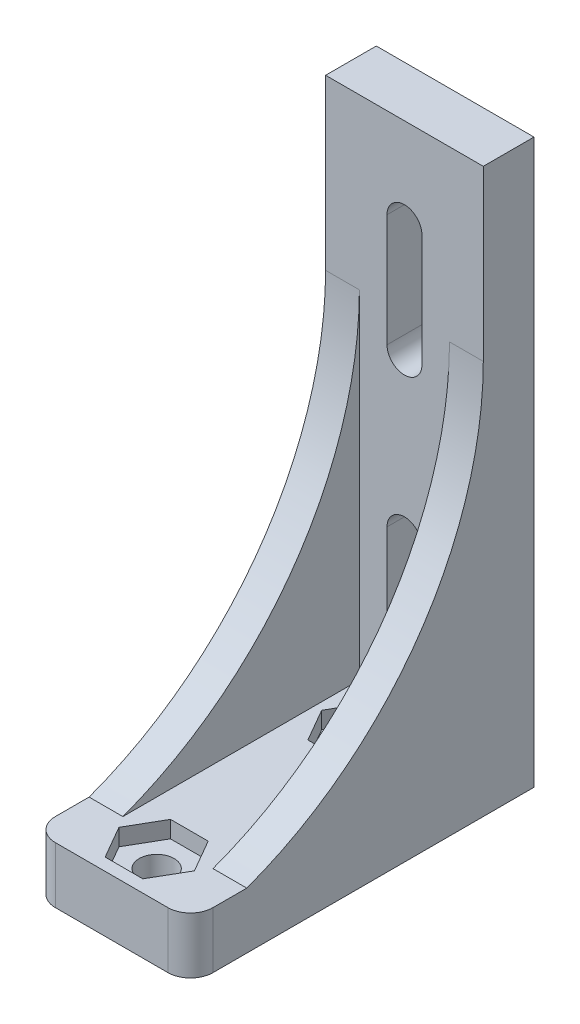
ISO-10303-21;
HEADER;
FILE_DESCRIPTION(('STEP AP214'),'2;1');
FILE_NAME('part.step','',(''),(''),'','','');
FILE_SCHEMA(('AUTOMOTIVE_DESIGN { 1 0 10303 214 1 1 1 1 }'));
ENDSEC;
DATA;
#1=APPLICATION_CONTEXT('core data for automotive mechanical design processes');
#2=APPLICATION_PROTOCOL_DEFINITION('international standard','automotive_design',2000,#1);
#3=PRODUCT_CONTEXT('',#1,'mechanical');
#4=PRODUCT('Part','Part','',(#3));
#5=PRODUCT_RELATED_PRODUCT_CATEGORY('part','',(#4));
#6=PRODUCT_DEFINITION_FORMATION('','',#4);
#7=PRODUCT_DEFINITION_CONTEXT('part definition',#1,'design');
#8=PRODUCT_DEFINITION('design','',#6,#7);
#9=PRODUCT_DEFINITION_SHAPE('','',#8);
#10=(LENGTH_UNIT() NAMED_UNIT(*) SI_UNIT(.MILLI.,.METRE.));
#11=(NAMED_UNIT(*) PLANE_ANGLE_UNIT() SI_UNIT($,.RADIAN.));
#12=(NAMED_UNIT(*) SI_UNIT($,.STERADIAN.) SOLID_ANGLE_UNIT());
#13=UNCERTAINTY_MEASURE_WITH_UNIT(LENGTH_MEASURE(1.E-05),#10,'distance_accuracy_value','');
#14=(GEOMETRIC_REPRESENTATION_CONTEXT(3) GLOBAL_UNCERTAINTY_ASSIGNED_CONTEXT((#13)) GLOBAL_UNIT_ASSIGNED_CONTEXT((#10,
#11,#12)) REPRESENTATION_CONTEXT('',''));
#15=CARTESIAN_POINT('',(0.,0.,0.));
#16=DIRECTION('',(0.,0.,1.));
#17=DIRECTION('',(1.,0.,0.));
#18=AXIS2_PLACEMENT_3D('',#15,#16,#17);
#19=CARTESIAN_POINT('',(50.6196668472011,35.0482499596085,5.99749994229783));
#20=DIRECTION('',(-1.,0.,0.));
#21=DIRECTION('',(0.,0.,1.));
#22=AXIS2_PLACEMENT_3D('',#19,#20,#21);
#23=CYLINDRICAL_SURFACE('',#22,31.997536321035);
#24=DIRECTION('',(-1.,0.,0.));
#25=VECTOR('',#24,1.);
#26=CARTESIAN_POINT('',(50.6196668472011,35.,-26.));
#27=LINE('',#26,#25);
#28=CARTESIAN_POINT('',(14.,35.,-26.));
#29=VERTEX_POINT('',#28);
#30=CARTESIAN_POINT('',(11.,34.9999999999909,-26.));
#31=VERTEX_POINT('',#30);
#32=EDGE_CURVE('E363',#29,#31,#27,.T.);
#33=ORIENTED_EDGE('',*,*,#32,.T.);
#34=CARTESIAN_POINT('',(11.,35.0482499596085,5.99749994229784));
#35=DIRECTION('',(-1.,0.,0.));
#36=DIRECTION('',(0.,0.,1.));
#37=AXIS2_PLACEMENT_3D('',#34,#35,#36);
#38=CIRCLE('',#37,31.997536321035);
#39=CARTESIAN_POINT('',(11.,5.,-5.));
#40=VERTEX_POINT('',#39);
#41=EDGE_CURVE('E287',#31,#40,#38,.T.);
#42=ORIENTED_EDGE('',*,*,#41,.T.);
#43=DIRECTION('',(-1.,0.,0.));
#44=VECTOR('',#43,1.);
#45=CARTESIAN_POINT('',(50.6196668472011,5.,-5.));
#46=LINE('',#45,#44);
#47=CARTESIAN_POINT('',(14.,5.,-5.));
#48=VERTEX_POINT('',#47);
#49=EDGE_CURVE('E370',#48,#40,#46,.T.);
#50=ORIENTED_EDGE('',*,*,#49,.F.);
#51=CARTESIAN_POINT('',(14.,35.0482499596085,5.99749994229784));
#52=DIRECTION('',(-1.,0.,0.));
#53=DIRECTION('',(0.,0.,1.));
#54=AXIS2_PLACEMENT_3D('',#51,#52,#53);
#55=CIRCLE('',#54,31.997536321035);
#56=EDGE_CURVE('E353',#29,#48,#55,.T.);
#57=ORIENTED_EDGE('',*,*,#56,.F.);
#58=EDGE_LOOP('',(#33,#42,#50,#57));
#59=FACE_BOUND('',#58,.T.);
#60=ADVANCED_FACE('F35',(#59),#23,.F.);
#61=CARTESIAN_POINT('',(3.,5.,-5.));
#62=VERTEX_POINT('',#61);
#63=CARTESIAN_POINT('',(0.,5.,-5.));
#64=VERTEX_POINT('',#63);
#65=EDGE_CURVE('E320',#62,#64,#46,.T.);
#66=ORIENTED_EDGE('',*,*,#65,.F.);
#67=CARTESIAN_POINT('',(3.,35.0482499596085,5.99749994229784));
#68=DIRECTION('',(1.,0.,0.));
#69=DIRECTION('',(0.,0.,-1.));
#70=AXIS2_PLACEMENT_3D('',#67,#68,#69);
#71=CIRCLE('',#70,31.997536321035);
#72=CARTESIAN_POINT('',(3.,34.9999999999954,-26.));
#73=VERTEX_POINT('',#72);
#74=EDGE_CURVE('E284',#62,#73,#71,.T.);
#75=ORIENTED_EDGE('',*,*,#74,.T.);
#76=CARTESIAN_POINT('',(0.,35.,-26.));
#77=VERTEX_POINT('',#76);
#78=EDGE_CURVE('E368',#73,#77,#27,.T.);
#79=ORIENTED_EDGE('',*,*,#78,.T.);
#80=CARTESIAN_POINT('',(0.,35.0482499596085,5.99749994229784));
#81=DIRECTION('',(1.,0.,0.));
#82=DIRECTION('',(0.,0.,1.));
#83=AXIS2_PLACEMENT_3D('',#80,#81,#82);
#84=CIRCLE('',#83,31.997536321035);
#85=EDGE_CURVE('E372',#64,#77,#84,.T.);
#86=ORIENTED_EDGE('',*,*,#85,.F.);
#87=EDGE_LOOP('',(#66,#75,#79,#86));
#88=FACE_BOUND('',#87,.T.);
#89=ADVANCED_FACE('F594',(#88),#23,.F.);
#90=CARTESIAN_POINT('',(7.,50.,-22.));
#91=DIRECTION('',(0.,-1.,0.));
#92=DIRECTION('',(0.,0.,-1.));
#93=AXIS2_PLACEMENT_3D('',#90,#91,#92);
#94=CYLINDRICAL_SURFACE('',#93,1.55);
#95=CARTESIAN_POINT('',(7.,0.,-22.));
#96=DIRECTION('',(0.,1.,0.));
#97=DIRECTION('',(0.,0.,1.));
#98=AXIS2_PLACEMENT_3D('',#95,#96,#97);
#99=CIRCLE('',#98,1.55);
#100=CARTESIAN_POINT('',(7.,0.,-20.45));
#101=VERTEX_POINT('',#100);
#102=EDGE_CURVE('E345',#101,#101,#99,.T.);
#103=ORIENTED_EDGE('',*,*,#102,.F.);
#104=EDGE_LOOP('',(#103));
#105=FACE_BOUND('',#104,.T.);
#106=CARTESIAN_POINT('',(7.,3.5,-22.));
#107=DIRECTION('',(0.,1.,0.));
#108=DIRECTION('',(0.,0.,1.));
#109=AXIS2_PLACEMENT_3D('',#106,#107,#108);
#110=CIRCLE('',#109,1.55);
#111=CARTESIAN_POINT('',(7.,3.5,-20.45));
#112=VERTEX_POINT('',#111);
#113=EDGE_CURVE('E279',#112,#112,#110,.T.);
#114=ORIENTED_EDGE('',*,*,#113,.T.);
#115=EDGE_LOOP('',(#114));
#116=FACE_BOUND('',#115,.T.);
#117=ADVANCED_FACE('F599',(#105,#116),#94,.F.);
#118=CARTESIAN_POINT('',(7.,50.,-4.));
#119=DIRECTION('',(0.,-1.,0.));
#120=DIRECTION('',(0.,0.,-1.));
#121=AXIS2_PLACEMENT_3D('',#118,#119,#120);
#122=CYLINDRICAL_SURFACE('',#121,1.55);
#123=CARTESIAN_POINT('',(7.,0.,-4.));
#124=DIRECTION('',(0.,1.,0.));
#125=DIRECTION('',(0.,0.,1.));
#126=AXIS2_PLACEMENT_3D('',#123,#124,#125);
#127=CIRCLE('',#126,1.55);
#128=CARTESIAN_POINT('',(7.,0.,-2.45));
#129=VERTEX_POINT('',#128);
#130=EDGE_CURVE('E342',#129,#129,#127,.T.);
#131=ORIENTED_EDGE('',*,*,#130,.F.);
#132=EDGE_LOOP('',(#131));
#133=FACE_BOUND('',#132,.T.);
#134=CARTESIAN_POINT('',(7.,3.5,-4.));
#135=DIRECTION('',(0.,1.,0.));
#136=DIRECTION('',(0.,0.,1.));
#137=AXIS2_PLACEMENT_3D('',#134,#135,#136);
#138=CIRCLE('',#137,1.55);
#139=CARTESIAN_POINT('',(7.,3.5,-2.45));
#140=VERTEX_POINT('',#139);
#141=EDGE_CURVE('E276',#140,#140,#138,.T.);
#142=ORIENTED_EDGE('',*,*,#141,.T.);
#143=EDGE_LOOP('',(#142));
#144=FACE_BOUND('',#143,.T.);
#145=ADVANCED_FACE('F677',(#133,#144),#122,.F.);
#146=CARTESIAN_POINT('',(0.,50.,0.));
#147=DIRECTION('',(0.,-1.,0.));
#148=DIRECTION('',(0.,0.,-1.));
#149=AXIS2_PLACEMENT_3D('',#146,#147,#148);
#150=PLANE('',#149);
#151=DIRECTION('',(0.,0.,-1.));
#152=VECTOR('',#151,1.);
#153=CARTESIAN_POINT('',(14.,50.,0.));
#154=LINE('',#153,#152);
#155=CARTESIAN_POINT('',(14.,50.,-26.));
#156=VERTEX_POINT('',#155);
#157=CARTESIAN_POINT('',(14.,50.,-30.5));
#158=VERTEX_POINT('',#157);
#159=EDGE_CURVE('E270',#156,#158,#154,.T.);
#160=ORIENTED_EDGE('',*,*,#159,.T.);
#161=DIRECTION('',(1.,0.,0.));
#162=VECTOR('',#161,1.);
#163=CARTESIAN_POINT('',(0.,50.,-30.5));
#164=LINE('',#163,#162);
#165=CARTESIAN_POINT('',(0.,50.,-30.5));
#166=VERTEX_POINT('',#165);
#167=EDGE_CURVE('E50',#166,#158,#164,.T.);
#168=ORIENTED_EDGE('',*,*,#167,.F.);
#169=DIRECTION('',(0.,0.,1.));
#170=VECTOR('',#169,1.);
#171=CARTESIAN_POINT('',(0.,50.,0.));
#172=LINE('',#171,#170);
#173=CARTESIAN_POINT('',(0.,50.,-26.));
#174=VERTEX_POINT('',#173);
#175=EDGE_CURVE('E267',#166,#174,#172,.T.);
#176=ORIENTED_EDGE('',*,*,#175,.T.);
#177=DIRECTION('',(-1.,0.,0.));
#178=VECTOR('',#177,1.);
#179=CARTESIAN_POINT('',(65.9711458407451,50.,-26.));
#180=LINE('',#179,#178);
#181=EDGE_CURVE('E322',#156,#174,#180,.T.);
#182=ORIENTED_EDGE('',*,*,#181,.F.);
#183=EDGE_LOOP('',(#160,#168,#176,#182));
#184=FACE_BOUND('',#183,.T.);
#185=ADVANCED_FACE('F350',(#184),#150,.F.);
#186=CARTESIAN_POINT('',(0.,0.,0.));
#187=DIRECTION('',(0.,-1.,0.));
#188=DIRECTION('',(0.,0.,-1.));
#189=AXIS2_PLACEMENT_3D('',#186,#187,#188);
#190=PLANE('',#189);
#191=DIRECTION('',(1.,0.,0.));
#192=VECTOR('',#191,1.);
#193=CARTESIAN_POINT('',(0.,0.,-30.5));
#194=LINE('',#193,#192);
#195=CARTESIAN_POINT('',(0.,0.,-30.5));
#196=VERTEX_POINT('',#195);
#197=CARTESIAN_POINT('',(14.,0.,-30.5));
#198=VERTEX_POINT('',#197);
#199=EDGE_CURVE('E245',#196,#198,#194,.T.);
#200=ORIENTED_EDGE('',*,*,#199,.T.);
#201=DIRECTION('',(0.,0.,-1.));
#202=VECTOR('',#201,1.);
#203=CARTESIAN_POINT('',(14.,0.,0.));
#204=LINE('',#203,#202);
#205=CARTESIAN_POINT('',(14.,0.,-2.));
#206=VERTEX_POINT('',#205);
#207=EDGE_CURVE('E258',#206,#198,#204,.T.);
#208=ORIENTED_EDGE('',*,*,#207,.F.);
#209=CARTESIAN_POINT('',(12.,0.,-2.));
#210=DIRECTION('',(0.,-1.,0.));
#211=DIRECTION('',(0.,0.,-1.));
#212=AXIS2_PLACEMENT_3D('',#209,#210,#211);
#213=CIRCLE('',#212,2.);
#214=CARTESIAN_POINT('',(12.,0.,0.));
#215=VERTEX_POINT('',#214);
#216=EDGE_CURVE('E293',#206,#215,#213,.T.);
#217=ORIENTED_EDGE('',*,*,#216,.T.);
#218=DIRECTION('',(1.,0.,0.));
#219=VECTOR('',#218,1.);
#220=CARTESIAN_POINT('',(0.,0.,0.));
#221=LINE('',#220,#219);
#222=CARTESIAN_POINT('',(2.,0.,0.));
#223=VERTEX_POINT('',#222);
#224=EDGE_CURVE('E268',#223,#215,#221,.T.);
#225=ORIENTED_EDGE('',*,*,#224,.F.);
#226=CARTESIAN_POINT('',(2.,0.,-2.));
#227=DIRECTION('',(0.,-1.,0.));
#228=DIRECTION('',(0.,0.,-1.));
#229=AXIS2_PLACEMENT_3D('',#226,#227,#228);
#230=CIRCLE('',#229,2.);
#231=CARTESIAN_POINT('',(0.,0.,-2.));
#232=VERTEX_POINT('',#231);
#233=EDGE_CURVE('E291',#223,#232,#230,.T.);
#234=ORIENTED_EDGE('',*,*,#233,.T.);
#235=DIRECTION('',(0.,0.,1.));
#236=VECTOR('',#235,1.);
#237=CARTESIAN_POINT('',(0.,0.,0.));
#238=LINE('',#237,#236);
#239=EDGE_CURVE('E260',#196,#232,#238,.T.);
#240=ORIENTED_EDGE('',*,*,#239,.F.);
#241=EDGE_LOOP('',(#200,#208,#217,#225,#234,#240));
#242=FACE_BOUND('',#241,.T.);
#243=ORIENTED_EDGE('',*,*,#102,.T.);
#244=EDGE_LOOP('',(#243));
#245=FACE_BOUND('',#244,.T.);
#246=ORIENTED_EDGE('',*,*,#130,.T.);
#247=EDGE_LOOP('',(#246));
#248=FACE_BOUND('',#247,.T.);
#249=ADVANCED_FACE('F256',(#242,#245,#248),#190,.T.);
#250=CARTESIAN_POINT('',(0.,50.,0.));
#251=DIRECTION('',(1.,0.,0.));
#252=DIRECTION('',(0.,0.,-1.));
#253=AXIS2_PLACEMENT_3D('',#250,#251,#252);
#254=PLANE('',#253);
#255=ORIENTED_EDGE('',*,*,#175,.F.);
#256=DIRECTION('',(0.,1.,0.));
#257=VECTOR('',#256,1.);
#258=CARTESIAN_POINT('',(0.,-14.0089257261219,-30.5));
#259=LINE('',#258,#257);
#260=EDGE_CURVE('E251',#196,#166,#259,.T.);
#261=ORIENTED_EDGE('',*,*,#260,.F.);
#262=ORIENTED_EDGE('',*,*,#239,.T.);
#263=DIRECTION('',(0.,-1.,0.));
#264=VECTOR('',#263,1.);
#265=CARTESIAN_POINT('',(0.,50.,-2.));
#266=LINE('',#265,#264);
#267=CARTESIAN_POINT('',(0.,5.,-2.));
#268=VERTEX_POINT('',#267);
#269=EDGE_CURVE('E43',#232,#268,#266,.F.);
#270=ORIENTED_EDGE('',*,*,#269,.T.);
#271=DIRECTION('',(0.,0.,1.));
#272=VECTOR('',#271,1.);
#273=CARTESIAN_POINT('',(0.,5.,0.));
#274=LINE('',#273,#272);
#275=EDGE_CURVE('E310',#64,#268,#274,.T.);
#276=ORIENTED_EDGE('',*,*,#275,.F.);
#277=ORIENTED_EDGE('',*,*,#85,.T.);
#278=DIRECTION('',(0.,-1.,0.));
#279=VECTOR('',#278,1.);
#280=CARTESIAN_POINT('',(0.,50.,-26.));
#281=LINE('',#280,#279);
#282=EDGE_CURVE('E323',#174,#77,#281,.T.);
#283=ORIENTED_EDGE('',*,*,#282,.F.);
#284=EDGE_LOOP('',(#255,#261,#262,#270,#276,#277,#283));
#285=FACE_BOUND('',#284,.T.);
#286=ADVANCED_FACE('F308',(#285),#254,.F.);
#287=CARTESIAN_POINT('',(0.,50.,0.));
#288=DIRECTION('',(0.,0.,-1.));
#289=DIRECTION('',(-1.,0.,0.));
#290=AXIS2_PLACEMENT_3D('',#287,#288,#289);
#291=PLANE('',#290);
#292=ORIENTED_EDGE('',*,*,#224,.T.);
#293=DIRECTION('',(0.,-1.,0.));
#294=VECTOR('',#293,1.);
#295=CARTESIAN_POINT('',(12.,50.,0.));
#296=LINE('',#295,#294);
#297=CARTESIAN_POINT('',(12.,5.,0.));
#298=VERTEX_POINT('',#297);
#299=EDGE_CURVE('E298',#215,#298,#296,.F.);
#300=ORIENTED_EDGE('',*,*,#299,.T.);
#301=DIRECTION('',(-1.,0.,0.));
#302=VECTOR('',#301,1.);
#303=CARTESIAN_POINT('',(65.9711458407451,5.,0.));
#304=LINE('',#303,#302);
#305=CARTESIAN_POINT('',(2.,5.,0.));
#306=VERTEX_POINT('',#305);
#307=EDGE_CURVE('E330',#298,#306,#304,.T.);
#308=ORIENTED_EDGE('',*,*,#307,.T.);
#309=DIRECTION('',(0.,-1.,0.));
#310=VECTOR('',#309,1.);
#311=CARTESIAN_POINT('',(2.,50.,0.));
#312=LINE('',#311,#310);
#313=EDGE_CURVE('E295',#306,#223,#312,.T.);
#314=ORIENTED_EDGE('',*,*,#313,.T.);
#315=EDGE_LOOP('',(#292,#300,#308,#314));
#316=FACE_BOUND('',#315,.T.);
#317=ADVANCED_FACE('F328',(#316),#291,.F.);
#318=CARTESIAN_POINT('',(14.,50.,0.));
#319=DIRECTION('',(-1.,0.,0.));
#320=DIRECTION('',(0.,0.,1.));
#321=AXIS2_PLACEMENT_3D('',#318,#319,#320);
#322=PLANE('',#321);
#323=ORIENTED_EDGE('',*,*,#207,.T.);
#324=DIRECTION('',(0.,1.,0.));
#325=VECTOR('',#324,1.);
#326=CARTESIAN_POINT('',(14.,-14.0089257261219,-30.5));
#327=LINE('',#326,#325);
#328=EDGE_CURVE('E241',#198,#158,#327,.T.);
#329=ORIENTED_EDGE('',*,*,#328,.T.);
#330=ORIENTED_EDGE('',*,*,#159,.F.);
#331=DIRECTION('',(0.,1.,0.));
#332=VECTOR('',#331,1.);
#333=CARTESIAN_POINT('',(14.,50.,-26.));
#334=LINE('',#333,#332);
#335=EDGE_CURVE('E334',#29,#156,#334,.T.);
#336=ORIENTED_EDGE('',*,*,#335,.F.);
#337=ORIENTED_EDGE('',*,*,#56,.T.);
#338=DIRECTION('',(0.,0.,-1.));
#339=VECTOR('',#338,1.);
#340=CARTESIAN_POINT('',(14.,5.,0.));
#341=LINE('',#340,#339);
#342=CARTESIAN_POINT('',(14.,5.,-2.));
#343=VERTEX_POINT('',#342);
#344=EDGE_CURVE('E336',#343,#48,#341,.T.);
#345=ORIENTED_EDGE('',*,*,#344,.F.);
#346=DIRECTION('',(0.,-1.,0.));
#347=VECTOR('',#346,1.);
#348=CARTESIAN_POINT('',(14.,50.,-2.));
#349=LINE('',#348,#347);
#350=EDGE_CURVE('E266',#343,#206,#349,.T.);
#351=ORIENTED_EDGE('',*,*,#350,.T.);
#352=EDGE_LOOP('',(#323,#329,#330,#336,#337,#345,#351));
#353=FACE_BOUND('',#352,.T.);
#354=ADVANCED_FACE('F263',(#353),#322,.F.);
#355=CARTESIAN_POINT('',(65.9711458407451,5.,0.));
#356=DIRECTION('',(0.,-1.,0.));
#357=DIRECTION('',(0.,0.,-1.));
#358=AXIS2_PLACEMENT_3D('',#355,#356,#357);
#359=PLANE('',#358);
#360=ORIENTED_EDGE('',*,*,#307,.F.);
#361=CARTESIAN_POINT('',(12.,5.,-2.));
#362=DIRECTION('',(0.,-1.,0.));
#363=DIRECTION('',(0.,0.,-1.));
#364=AXIS2_PLACEMENT_3D('',#361,#362,#363);
#365=CIRCLE('',#364,2.);
#366=EDGE_CURVE('E302',#298,#343,#365,.F.);
#367=ORIENTED_EDGE('',*,*,#366,.T.);
#368=ORIENTED_EDGE('',*,*,#344,.T.);
#369=ORIENTED_EDGE('',*,*,#49,.T.);
#370=DIRECTION('',(0.,0.,1.));
#371=VECTOR('',#370,1.);
#372=CARTESIAN_POINT('',(11.,5.,-26.));
#373=LINE('',#372,#371);
#374=CARTESIAN_POINT('',(11.,5.,-26.));
#375=VERTEX_POINT('',#374);
#376=EDGE_CURVE('E525',#375,#40,#373,.T.);
#377=ORIENTED_EDGE('',*,*,#376,.F.);
#378=DIRECTION('',(1.,0.,0.));
#379=VECTOR('',#378,1.);
#380=CARTESIAN_POINT('',(3.,5.,-26.));
#381=LINE('',#380,#379);
#382=CARTESIAN_POINT('',(3.,5.,-26.));
#383=VERTEX_POINT('',#382);
#384=EDGE_CURVE('E526',#383,#375,#381,.T.);
#385=ORIENTED_EDGE('',*,*,#384,.F.);
#386=DIRECTION('',(0.,0.,-1.));
#387=VECTOR('',#386,1.);
#388=CARTESIAN_POINT('',(3.,5.,-26.));
#389=LINE('',#388,#387);
#390=EDGE_CURVE('E532',#62,#383,#389,.T.);
#391=ORIENTED_EDGE('',*,*,#390,.F.);
#392=ORIENTED_EDGE('',*,*,#65,.T.);
#393=ORIENTED_EDGE('',*,*,#275,.T.);
#394=CARTESIAN_POINT('',(2.,5.,-2.));
#395=DIRECTION('',(0.,-1.,0.));
#396=DIRECTION('',(0.,0.,-1.));
#397=AXIS2_PLACEMENT_3D('',#394,#395,#396);
#398=CIRCLE('',#397,2.);
#399=EDGE_CURVE('E300',#268,#306,#398,.F.);
#400=ORIENTED_EDGE('',*,*,#399,.T.);
#401=EDGE_LOOP('',(#360,#367,#368,#369,#377,#385,#391,#392,#393,#400));
#402=FACE_BOUND('',#401,.T.);
#403=DIRECTION('',(0.5,0.,0.866025403784439));
#404=VECTOR('',#403,1.);
#405=CARTESIAN_POINT('',(3.65136843870018,5.,-4.));
#406=LINE('',#405,#404);
#407=CARTESIAN_POINT('',(3.65136843870018,5.,-4.));
#408=VERTEX_POINT('',#407);
#409=CARTESIAN_POINT('',(5.32568421935009,5.,-1.1));
#410=VERTEX_POINT('',#409);
#411=EDGE_CURVE('E405',#408,#410,#406,.T.);
#412=ORIENTED_EDGE('',*,*,#411,.F.);
#413=DIRECTION('',(-0.5,0.,0.866025403784439));
#414=VECTOR('',#413,1.);
#415=CARTESIAN_POINT('',(5.32568421935009,5.,-6.9));
#416=LINE('',#415,#414);
#417=CARTESIAN_POINT('',(5.32568421935009,5.,-6.9));
#418=VERTEX_POINT('',#417);
#419=EDGE_CURVE('E403',#418,#408,#416,.T.);
#420=ORIENTED_EDGE('',*,*,#419,.F.);
#421=DIRECTION('',(-1.,0.,0.));
#422=VECTOR('',#421,1.);
#423=CARTESIAN_POINT('',(8.67431578064992,5.,-6.9));
#424=LINE('',#423,#422);
#425=CARTESIAN_POINT('',(8.67431578064992,5.,-6.9));
#426=VERTEX_POINT('',#425);
#427=EDGE_CURVE('E400',#426,#418,#424,.T.);
#428=ORIENTED_EDGE('',*,*,#427,.F.);
#429=DIRECTION('',(-0.5,0.,-0.866025403784438));
#430=VECTOR('',#429,1.);
#431=CARTESIAN_POINT('',(10.3486315612998,5.,-4.));
#432=LINE('',#431,#430);
#433=CARTESIAN_POINT('',(10.3486315612998,5.,-4.));
#434=VERTEX_POINT('',#433);
#435=EDGE_CURVE('E397',#434,#426,#432,.T.);
#436=ORIENTED_EDGE('',*,*,#435,.F.);
#437=DIRECTION('',(0.5,0.,-0.866025403784439));
#438=VECTOR('',#437,1.);
#439=CARTESIAN_POINT('',(8.67431578064992,5.,-1.1));
#440=LINE('',#439,#438);
#441=CARTESIAN_POINT('',(8.67431578064992,5.,-1.1));
#442=VERTEX_POINT('',#441);
#443=EDGE_CURVE('E395',#442,#434,#440,.T.);
#444=ORIENTED_EDGE('',*,*,#443,.F.);
#445=DIRECTION('',(1.,0.,0.));
#446=VECTOR('',#445,1.);
#447=CARTESIAN_POINT('',(5.32568421935009,5.,-1.1));
#448=LINE('',#447,#446);
#449=EDGE_CURVE('E379',#410,#442,#448,.T.);
#450=ORIENTED_EDGE('',*,*,#449,.F.);
#451=EDGE_LOOP('',(#412,#420,#428,#436,#444,#450));
#452=FACE_BOUND('',#451,.T.);
#453=DIRECTION('',(0.5,0.,0.866025403784439));
#454=VECTOR('',#453,1.);
#455=CARTESIAN_POINT('',(3.65136843870017,5.,-22.));
#456=LINE('',#455,#454);
#457=CARTESIAN_POINT('',(3.65136843870017,5.,-22.));
#458=VERTEX_POINT('',#457);
#459=CARTESIAN_POINT('',(5.32568421935008,5.,-19.1));
#460=VERTEX_POINT('',#459);
#461=EDGE_CURVE('E428',#458,#460,#456,.T.);
#462=ORIENTED_EDGE('',*,*,#461,.F.);
#463=DIRECTION('',(-0.5,0.,0.866025403784439));
#464=VECTOR('',#463,1.);
#465=CARTESIAN_POINT('',(5.32568421935009,5.,-24.9));
#466=LINE('',#465,#464);
#467=CARTESIAN_POINT('',(5.32568421935009,5.,-24.9));
#468=VERTEX_POINT('',#467);
#469=EDGE_CURVE('E456',#468,#458,#466,.T.);
#470=ORIENTED_EDGE('',*,*,#469,.F.);
#471=DIRECTION('',(-1.,0.,0.));
#472=VECTOR('',#471,1.);
#473=CARTESIAN_POINT('',(8.67431578064991,5.,-24.9));
#474=LINE('',#473,#472);
#475=CARTESIAN_POINT('',(8.67431578064991,5.,-24.9));
#476=VERTEX_POINT('',#475);
#477=EDGE_CURVE('E453',#476,#468,#474,.T.);
#478=ORIENTED_EDGE('',*,*,#477,.F.);
#479=DIRECTION('',(-0.5,0.,-0.866025403784439));
#480=VECTOR('',#479,1.);
#481=CARTESIAN_POINT('',(10.3486315612998,5.,-22.));
#482=LINE('',#481,#480);
#483=CARTESIAN_POINT('',(10.3486315612998,5.,-22.));
#484=VERTEX_POINT('',#483);
#485=EDGE_CURVE('E450',#484,#476,#482,.T.);
#486=ORIENTED_EDGE('',*,*,#485,.F.);
#487=DIRECTION('',(0.5,0.,-0.866025403784439));
#488=VECTOR('',#487,1.);
#489=CARTESIAN_POINT('',(8.67431578064991,5.,-19.1));
#490=LINE('',#489,#488);
#491=CARTESIAN_POINT('',(8.67431578064991,5.,-19.1));
#492=VERTEX_POINT('',#491);
#493=EDGE_CURVE('E447',#492,#484,#490,.T.);
#494=ORIENTED_EDGE('',*,*,#493,.F.);
#495=DIRECTION('',(1.,0.,0.));
#496=VECTOR('',#495,1.);
#497=CARTESIAN_POINT('',(5.32568421935008,5.,-19.1));
#498=LINE('',#497,#496);
#499=EDGE_CURVE('E444',#460,#492,#498,.T.);
#500=ORIENTED_EDGE('',*,*,#499,.F.);
#501=EDGE_LOOP('',(#462,#470,#478,#486,#494,#500));
#502=FACE_BOUND('',#501,.T.);
#503=ADVANCED_FACE('F315',(#402,#452,#502),#359,.F.);
#504=CARTESIAN_POINT('',(65.9711458407451,50.,-26.));
#505=DIRECTION('',(0.,0.,-1.));
#506=DIRECTION('',(-1.,0.,0.));
#507=AXIS2_PLACEMENT_3D('',#504,#505,#506);
#508=PLANE('',#507);
#509=ORIENTED_EDGE('',*,*,#181,.T.);
#510=ORIENTED_EDGE('',*,*,#282,.T.);
#511=ORIENTED_EDGE('',*,*,#78,.F.);
#512=DIRECTION('',(0.,1.,0.));
#513=VECTOR('',#512,1.);
#514=CARTESIAN_POINT('',(3.,-29.3548497304238,-26.));
#515=LINE('',#514,#513);
#516=EDGE_CURVE('E530',#383,#73,#515,.T.);
#517=ORIENTED_EDGE('',*,*,#516,.F.);
#518=ORIENTED_EDGE('',*,*,#384,.T.);
#519=DIRECTION('',(0.,1.,0.));
#520=VECTOR('',#519,1.);
#521=CARTESIAN_POINT('',(11.,-29.3548497304238,-26.));
#522=LINE('',#521,#520);
#523=EDGE_CURVE('E366',#375,#31,#522,.T.);
#524=ORIENTED_EDGE('',*,*,#523,.T.);
#525=ORIENTED_EDGE('',*,*,#32,.F.);
#526=ORIENTED_EDGE('',*,*,#335,.T.);
#527=EDGE_LOOP('',(#509,#510,#511,#517,#518,#524,#525,#526));
#528=FACE_BOUND('',#527,.T.);
#529=CARTESIAN_POINT('',(6.99999999999999,42.,-26.));
#530=DIRECTION('',(0.,0.,-1.));
#531=DIRECTION('',(-1.,0.,0.));
#532=AXIS2_PLACEMENT_3D('',#529,#530,#531);
#533=CIRCLE('',#532,1.55);
#534=CARTESIAN_POINT('',(8.55,42.,-26.));
#535=VERTEX_POINT('',#534);
#536=CARTESIAN_POINT('',(5.45,42.,-26.));
#537=VERTEX_POINT('',#536);
#538=EDGE_CURVE('E502',#535,#537,#533,.F.);
#539=ORIENTED_EDGE('',*,*,#538,.F.);
#540=DIRECTION('',(0.,1.,0.));
#541=VECTOR('',#540,1.);
#542=CARTESIAN_POINT('',(8.55,32.,-26.));
#543=LINE('',#542,#541);
#544=CARTESIAN_POINT('',(8.55,32.,-26.));
#545=VERTEX_POINT('',#544);
#546=EDGE_CURVE('E505',#545,#535,#543,.T.);
#547=ORIENTED_EDGE('',*,*,#546,.F.);
#548=CARTESIAN_POINT('',(6.99999999999999,32.,-26.));
#549=DIRECTION('',(0.,0.,-1.));
#550=DIRECTION('',(-1.,0.,0.));
#551=AXIS2_PLACEMENT_3D('',#548,#549,#550);
#552=CIRCLE('',#551,1.55);
#553=CARTESIAN_POINT('',(5.44999999999999,32.,-26.));
#554=VERTEX_POINT('',#553);
#555=EDGE_CURVE('E508',#554,#545,#552,.F.);
#556=ORIENTED_EDGE('',*,*,#555,.F.);
#557=DIRECTION('',(0.,-1.,0.));
#558=VECTOR('',#557,1.);
#559=CARTESIAN_POINT('',(5.44999999999999,32.,-26.));
#560=LINE('',#559,#558);
#561=EDGE_CURVE('E499',#537,#554,#560,.T.);
#562=ORIENTED_EDGE('',*,*,#561,.F.);
#563=EDGE_LOOP('',(#539,#547,#556,#562));
#564=FACE_BOUND('',#563,.T.);
#565=CARTESIAN_POINT('',(6.99999999999999,8.,-26.));
#566=DIRECTION('',(0.,0.,-1.));
#567=DIRECTION('',(-1.,0.,0.));
#568=AXIS2_PLACEMENT_3D('',#565,#566,#567);
#569=CIRCLE('',#568,1.55);
#570=CARTESIAN_POINT('',(5.44999999999999,8.,-26.));
#571=VERTEX_POINT('',#570);
#572=CARTESIAN_POINT('',(8.55,8.,-26.));
#573=VERTEX_POINT('',#572);
#574=EDGE_CURVE('E484',#571,#573,#569,.F.);
#575=ORIENTED_EDGE('',*,*,#574,.F.);
#576=DIRECTION('',(0.,-1.,0.));
#577=VECTOR('',#576,1.);
#578=CARTESIAN_POINT('',(5.44999999999999,8.,-26.));
#579=LINE('',#578,#577);
#580=CARTESIAN_POINT('',(5.44999999999999,18.,-26.));
#581=VERTEX_POINT('',#580);
#582=EDGE_CURVE('E487',#581,#571,#579,.T.);
#583=ORIENTED_EDGE('',*,*,#582,.F.);
#584=CARTESIAN_POINT('',(6.99999999999999,18.,-26.));
#585=DIRECTION('',(0.,0.,-1.));
#586=DIRECTION('',(-1.,0.,0.));
#587=AXIS2_PLACEMENT_3D('',#584,#585,#586);
#588=CIRCLE('',#587,1.55);
#589=CARTESIAN_POINT('',(8.55,18.,-26.));
#590=VERTEX_POINT('',#589);
#591=EDGE_CURVE('E477',#590,#581,#588,.F.);
#592=ORIENTED_EDGE('',*,*,#591,.F.);
#593=DIRECTION('',(0.,1.,0.));
#594=VECTOR('',#593,1.);
#595=CARTESIAN_POINT('',(8.55,8.,-26.));
#596=LINE('',#595,#594);
#597=EDGE_CURVE('E480',#573,#590,#596,.T.);
#598=ORIENTED_EDGE('',*,*,#597,.F.);
#599=EDGE_LOOP('',(#575,#583,#592,#598));
#600=FACE_BOUND('',#599,.T.);
#601=ADVANCED_FACE('F357',(#528,#564,#600),#508,.F.);
#602=CARTESIAN_POINT('',(6.99999999999999,32.,-12.5382022003003));
#603=DIRECTION('',(0.,0.,-1.));
#604=DIRECTION('',(-1.,0.,0.));
#605=AXIS2_PLACEMENT_3D('',#602,#603,#604);
#606=CYLINDRICAL_SURFACE('',#605,1.55);
#607=DIRECTION('',(0.,0.,-1.));
#608=VECTOR('',#607,1.);
#609=CARTESIAN_POINT('',(8.55,32.,-12.5382022003003));
#610=LINE('',#609,#608);
#611=CARTESIAN_POINT('',(8.55,32.,-30.5));
#612=VERTEX_POINT('',#611);
#613=EDGE_CURVE('E506',#545,#612,#610,.T.);
#614=ORIENTED_EDGE('',*,*,#613,.T.);
#615=CARTESIAN_POINT('',(6.99999999999999,32.,-30.5));
#616=DIRECTION('',(0.,0.,1.));
#617=DIRECTION('',(1.,0.,0.));
#618=AXIS2_PLACEMENT_3D('',#615,#616,#617);
#619=CIRCLE('',#618,1.55);
#620=CARTESIAN_POINT('',(5.44999999999999,32.,-30.5));
#621=VERTEX_POINT('',#620);
#622=EDGE_CURVE('E534',#612,#621,#619,.F.);
#623=ORIENTED_EDGE('',*,*,#622,.T.);
#624=DIRECTION('',(0.,0.,-1.));
#625=VECTOR('',#624,1.);
#626=CARTESIAN_POINT('',(5.44999999999999,32.,-12.5382022003003));
#627=LINE('',#626,#625);
#628=EDGE_CURVE('E283',#554,#621,#627,.T.);
#629=ORIENTED_EDGE('',*,*,#628,.F.);
#630=ORIENTED_EDGE('',*,*,#555,.T.);
#631=EDGE_LOOP('',(#614,#623,#629,#630));
#632=FACE_BOUND('',#631,.T.);
#633=ADVANCED_FACE('F581',(#632),#606,.F.);
#634=CARTESIAN_POINT('',(8.55,32.,-12.5382022003003));
#635=DIRECTION('',(1.,0.,0.));
#636=DIRECTION('',(0.,0.,-1.));
#637=AXIS2_PLACEMENT_3D('',#634,#635,#636);
#638=PLANE('',#637);
#639=DIRECTION('',(0.,0.,-1.));
#640=VECTOR('',#639,1.);
#641=CARTESIAN_POINT('',(8.55,42.,-12.5382022003003));
#642=LINE('',#641,#640);
#643=CARTESIAN_POINT('',(8.55,42.,-30.5));
#644=VERTEX_POINT('',#643);
#645=EDGE_CURVE('E513',#535,#644,#642,.T.);
#646=ORIENTED_EDGE('',*,*,#645,.T.);
#647=DIRECTION('',(0.,-1.,0.));
#648=VECTOR('',#647,1.);
#649=CARTESIAN_POINT('',(8.55,32.,-30.5));
#650=LINE('',#649,#648);
#651=EDGE_CURVE('E539',#644,#612,#650,.T.);
#652=ORIENTED_EDGE('',*,*,#651,.T.);
#653=ORIENTED_EDGE('',*,*,#613,.F.);
#654=ORIENTED_EDGE('',*,*,#546,.T.);
#655=EDGE_LOOP('',(#646,#652,#653,#654));
#656=FACE_BOUND('',#655,.T.);
#657=ADVANCED_FACE('F576',(#656),#638,.F.);
#658=CARTESIAN_POINT('',(6.99999999999999,42.,-12.5382022003003));
#659=DIRECTION('',(0.,0.,-1.));
#660=DIRECTION('',(-1.,0.,0.));
#661=AXIS2_PLACEMENT_3D('',#658,#659,#660);
#662=CYLINDRICAL_SURFACE('',#661,1.55);
#663=DIRECTION('',(0.,0.,-1.));
#664=VECTOR('',#663,1.);
#665=CARTESIAN_POINT('',(5.44999999999999,42.,-12.5382022003003));
#666=LINE('',#665,#664);
#667=CARTESIAN_POINT('',(5.44999999999999,42.,-30.5));
#668=VERTEX_POINT('',#667);
#669=EDGE_CURVE('E516',#537,#668,#666,.T.);
#670=ORIENTED_EDGE('',*,*,#669,.T.);
#671=CARTESIAN_POINT('',(6.99999999999999,42.,-30.5));
#672=DIRECTION('',(0.,0.,1.));
#673=DIRECTION('',(1.,0.,0.));
#674=AXIS2_PLACEMENT_3D('',#671,#672,#673);
#675=CIRCLE('',#674,1.55);
#676=EDGE_CURVE('E58',#668,#644,#675,.F.);
#677=ORIENTED_EDGE('',*,*,#676,.T.);
#678=ORIENTED_EDGE('',*,*,#645,.F.);
#679=ORIENTED_EDGE('',*,*,#538,.T.);
#680=EDGE_LOOP('',(#670,#677,#678,#679));
#681=FACE_BOUND('',#680,.T.);
#682=ADVANCED_FACE('F574',(#681),#662,.F.);
#683=CARTESIAN_POINT('',(5.44999999999999,32.,-12.5382022003003));
#684=DIRECTION('',(-1.,0.,0.));
#685=DIRECTION('',(0.,0.,1.));
#686=AXIS2_PLACEMENT_3D('',#683,#684,#685);
#687=PLANE('',#686);
#688=ORIENTED_EDGE('',*,*,#628,.T.);
#689=DIRECTION('',(0.,1.,0.));
#690=VECTOR('',#689,1.);
#691=CARTESIAN_POINT('',(5.44999999999999,32.,-30.5));
#692=LINE('',#691,#690);
#693=EDGE_CURVE('E543',#621,#668,#692,.T.);
#694=ORIENTED_EDGE('',*,*,#693,.T.);
#695=ORIENTED_EDGE('',*,*,#669,.F.);
#696=ORIENTED_EDGE('',*,*,#561,.T.);
#697=EDGE_LOOP('',(#688,#694,#695,#696));
#698=FACE_BOUND('',#697,.T.);
#699=ADVANCED_FACE('F583',(#698),#687,.F.);
#700=CARTESIAN_POINT('',(6.99999999999999,8.,-12.5382022003003));
#701=DIRECTION('',(0.,0.,-1.));
#702=DIRECTION('',(-1.,0.,0.));
#703=AXIS2_PLACEMENT_3D('',#700,#701,#702);
#704=CYLINDRICAL_SURFACE('',#703,1.55);
#705=DIRECTION('',(0.,0.,-1.));
#706=VECTOR('',#705,1.);
#707=CARTESIAN_POINT('',(8.55,8.,-12.5382022003003));
#708=LINE('',#707,#706);
#709=CARTESIAN_POINT('',(8.55,8.,-30.5));
#710=VERTEX_POINT('',#709);
#711=EDGE_CURVE('E481',#573,#710,#708,.T.);
#712=ORIENTED_EDGE('',*,*,#711,.T.);
#713=CARTESIAN_POINT('',(6.99999999999999,8.,-30.5));
#714=DIRECTION('',(0.,0.,1.));
#715=DIRECTION('',(1.,0.,0.));
#716=AXIS2_PLACEMENT_3D('',#713,#714,#715);
#717=CIRCLE('',#716,1.55);
#718=CARTESIAN_POINT('',(5.44999999999999,8.,-30.5));
#719=VERTEX_POINT('',#718);
#720=EDGE_CURVE('E545',#710,#719,#717,.F.);
#721=ORIENTED_EDGE('',*,*,#720,.T.);
#722=DIRECTION('',(0.,0.,-1.));
#723=VECTOR('',#722,1.);
#724=CARTESIAN_POINT('',(5.44999999999999,8.,-12.5382022003003));
#725=LINE('',#724,#723);
#726=EDGE_CURVE('E496',#571,#719,#725,.T.);
#727=ORIENTED_EDGE('',*,*,#726,.F.);
#728=ORIENTED_EDGE('',*,*,#574,.T.);
#729=EDGE_LOOP('',(#712,#721,#727,#728));
#730=FACE_BOUND('',#729,.T.);
#731=ADVANCED_FACE('F565',(#730),#704,.F.);
#732=CARTESIAN_POINT('',(8.55,8.,-12.5382022003003));
#733=DIRECTION('',(1.,0.,0.));
#734=DIRECTION('',(0.,0.,-1.));
#735=AXIS2_PLACEMENT_3D('',#732,#733,#734);
#736=PLANE('',#735);
#737=DIRECTION('',(0.,0.,-1.));
#738=VECTOR('',#737,1.);
#739=CARTESIAN_POINT('',(8.55,18.,-12.5382022003003));
#740=LINE('',#739,#738);
#741=CARTESIAN_POINT('',(8.55,18.,-30.5));
#742=VERTEX_POINT('',#741);
#743=EDGE_CURVE('E490',#590,#742,#740,.T.);
#744=ORIENTED_EDGE('',*,*,#743,.T.);
#745=DIRECTION('',(0.,-1.,0.));
#746=VECTOR('',#745,1.);
#747=CARTESIAN_POINT('',(8.55,8.,-30.5));
#748=LINE('',#747,#746);
#749=EDGE_CURVE('E548',#742,#710,#748,.T.);
#750=ORIENTED_EDGE('',*,*,#749,.T.);
#751=ORIENTED_EDGE('',*,*,#711,.F.);
#752=ORIENTED_EDGE('',*,*,#597,.T.);
#753=EDGE_LOOP('',(#744,#750,#751,#752));
#754=FACE_BOUND('',#753,.T.);
#755=ADVANCED_FACE('F560',(#754),#736,.F.);
#756=CARTESIAN_POINT('',(6.99999999999999,18.,-12.5382022003003));
#757=DIRECTION('',(0.,0.,-1.));
#758=DIRECTION('',(-1.,0.,0.));
#759=AXIS2_PLACEMENT_3D('',#756,#757,#758);
#760=CYLINDRICAL_SURFACE('',#759,1.55);
#761=DIRECTION('',(0.,0.,-1.));
#762=VECTOR('',#761,1.);
#763=CARTESIAN_POINT('',(5.44999999999999,18.,-12.5382022003003));
#764=LINE('',#763,#762);
#765=CARTESIAN_POINT('',(5.44999999999999,18.,-30.5));
#766=VERTEX_POINT('',#765);
#767=EDGE_CURVE('E493',#581,#766,#764,.T.);
#768=ORIENTED_EDGE('',*,*,#767,.T.);
#769=CARTESIAN_POINT('',(6.99999999999999,18.,-30.5));
#770=DIRECTION('',(0.,0.,1.));
#771=DIRECTION('',(1.,0.,0.));
#772=AXIS2_PLACEMENT_3D('',#769,#770,#771);
#773=CIRCLE('',#772,1.55);
#774=EDGE_CURVE('E551',#766,#742,#773,.F.);
#775=ORIENTED_EDGE('',*,*,#774,.T.);
#776=ORIENTED_EDGE('',*,*,#743,.F.);
#777=ORIENTED_EDGE('',*,*,#591,.T.);
#778=EDGE_LOOP('',(#768,#775,#776,#777));
#779=FACE_BOUND('',#778,.T.);
#780=ADVANCED_FACE('F557',(#779),#760,.F.);
#781=CARTESIAN_POINT('',(5.44999999999999,8.,-12.5382022003003));
#782=DIRECTION('',(-1.,0.,0.));
#783=DIRECTION('',(0.,0.,1.));
#784=AXIS2_PLACEMENT_3D('',#781,#782,#783);
#785=PLANE('',#784);
#786=ORIENTED_EDGE('',*,*,#726,.T.);
#787=DIRECTION('',(0.,1.,0.));
#788=VECTOR('',#787,1.);
#789=CARTESIAN_POINT('',(5.44999999999999,8.,-30.5));
#790=LINE('',#789,#788);
#791=EDGE_CURVE('E12',#719,#766,#790,.T.);
#792=ORIENTED_EDGE('',*,*,#791,.T.);
#793=ORIENTED_EDGE('',*,*,#767,.F.);
#794=ORIENTED_EDGE('',*,*,#582,.T.);
#795=EDGE_LOOP('',(#786,#792,#793,#794));
#796=FACE_BOUND('',#795,.T.);
#797=ADVANCED_FACE('F567',(#796),#785,.F.);
#798=CARTESIAN_POINT('',(5.32568421935008,3.5,-19.1));
#799=DIRECTION('',(0.,0.,1.));
#800=DIRECTION('',(0.,-1.,0.));
#801=AXIS2_PLACEMENT_3D('',#798,#799,#800);
#802=PLANE('',#801);
#803=ORIENTED_EDGE('',*,*,#499,.T.);
#804=DIRECTION('',(0.,1.,0.));
#805=VECTOR('',#804,1.);
#806=CARTESIAN_POINT('',(8.67431578064991,3.5,-19.1));
#807=LINE('',#806,#805);
#808=CARTESIAN_POINT('',(8.67431578064991,3.5,-19.1));
#809=VERTEX_POINT('',#808);
#810=EDGE_CURVE('E443',#809,#492,#807,.T.);
#811=ORIENTED_EDGE('',*,*,#810,.F.);
#812=DIRECTION('',(1.,0.,0.));
#813=VECTOR('',#812,1.);
#814=CARTESIAN_POINT('',(5.32568421935008,3.5,-19.1));
#815=LINE('',#814,#813);
#816=CARTESIAN_POINT('',(5.32568421935008,3.5,-19.1));
#817=VERTEX_POINT('',#816);
#818=EDGE_CURVE('E424',#817,#809,#815,.T.);
#819=ORIENTED_EDGE('',*,*,#818,.F.);
#820=DIRECTION('',(0.,1.,0.));
#821=VECTOR('',#820,1.);
#822=CARTESIAN_POINT('',(5.32568421935008,3.5,-19.1));
#823=LINE('',#822,#821);
#824=EDGE_CURVE('E398',#817,#460,#823,.T.);
#825=ORIENTED_EDGE('',*,*,#824,.T.);
#826=EDGE_LOOP('',(#803,#811,#819,#825));
#827=FACE_BOUND('',#826,.T.);
#828=ADVANCED_FACE('F641',(#827),#802,.F.);
#829=CARTESIAN_POINT('',(3.65136843870017,3.5,-22.));
#830=DIRECTION('',(-0.866025403784439,0.,0.5));
#831=DIRECTION('',(0.5,0.,0.866025403784439));
#832=AXIS2_PLACEMENT_3D('',#829,#830,#831);
#833=PLANE('',#832);
#834=ORIENTED_EDGE('',*,*,#461,.T.);
#835=ORIENTED_EDGE('',*,*,#824,.F.);
#836=DIRECTION('',(0.5,0.,0.866025403784439));
#837=VECTOR('',#836,1.);
#838=CARTESIAN_POINT('',(3.65136843870017,3.5,-22.));
#839=LINE('',#838,#837);
#840=CARTESIAN_POINT('',(3.65136843870017,3.5,-22.));
#841=VERTEX_POINT('',#840);
#842=EDGE_CURVE('E440',#841,#817,#839,.T.);
#843=ORIENTED_EDGE('',*,*,#842,.F.);
#844=DIRECTION('',(0.,1.,0.));
#845=VECTOR('',#844,1.);
#846=CARTESIAN_POINT('',(3.65136843870017,3.5,-22.));
#847=LINE('',#846,#845);
#848=EDGE_CURVE('E463',#841,#458,#847,.T.);
#849=ORIENTED_EDGE('',*,*,#848,.T.);
#850=EDGE_LOOP('',(#834,#835,#843,#849));
#851=FACE_BOUND('',#850,.T.);
#852=ADVANCED_FACE('F637',(#851),#833,.F.);
#853=CARTESIAN_POINT('',(5.32568421935009,3.5,-24.9));
#854=DIRECTION('',(-0.866025403784439,0.,-0.5));
#855=DIRECTION('',(-0.5,0.,0.866025403784439));
#856=AXIS2_PLACEMENT_3D('',#853,#854,#855);
#857=PLANE('',#856);
#858=ORIENTED_EDGE('',*,*,#469,.T.);
#859=ORIENTED_EDGE('',*,*,#848,.F.);
#860=DIRECTION('',(-0.5,0.,0.866025403784439));
#861=VECTOR('',#860,1.);
#862=CARTESIAN_POINT('',(5.32568421935009,3.5,-24.9));
#863=LINE('',#862,#861);
#864=CARTESIAN_POINT('',(5.32568421935009,3.5,-24.9));
#865=VERTEX_POINT('',#864);
#866=EDGE_CURVE('E437',#865,#841,#863,.T.);
#867=ORIENTED_EDGE('',*,*,#866,.F.);
#868=DIRECTION('',(0.,1.,0.));
#869=VECTOR('',#868,1.);
#870=CARTESIAN_POINT('',(5.32568421935009,3.5,-24.9));
#871=LINE('',#870,#869);
#872=EDGE_CURVE('E466',#865,#468,#871,.T.);
#873=ORIENTED_EDGE('',*,*,#872,.T.);
#874=EDGE_LOOP('',(#858,#859,#867,#873));
#875=FACE_BOUND('',#874,.T.);
#876=ADVANCED_FACE('F640',(#875),#857,.F.);
#877=CARTESIAN_POINT('',(8.67431578064991,3.5,-24.9));
#878=DIRECTION('',(0.,0.,-1.));
#879=DIRECTION('',(0.,1.,0.));
#880=AXIS2_PLACEMENT_3D('',#877,#878,#879);
#881=PLANE('',#880);
#882=ORIENTED_EDGE('',*,*,#477,.T.);
#883=ORIENTED_EDGE('',*,*,#872,.F.);
#884=DIRECTION('',(-1.,0.,0.));
#885=VECTOR('',#884,1.);
#886=CARTESIAN_POINT('',(8.67431578064991,3.5,-24.9));
#887=LINE('',#886,#885);
#888=CARTESIAN_POINT('',(8.67431578064991,3.5,-24.9));
#889=VERTEX_POINT('',#888);
#890=EDGE_CURVE('E434',#889,#865,#887,.T.);
#891=ORIENTED_EDGE('',*,*,#890,.F.);
#892=DIRECTION('',(0.,1.,0.));
#893=VECTOR('',#892,1.);
#894=CARTESIAN_POINT('',(8.67431578064991,3.5,-24.9));
#895=LINE('',#894,#893);
#896=EDGE_CURVE('E469',#889,#476,#895,.T.);
#897=ORIENTED_EDGE('',*,*,#896,.T.);
#898=EDGE_LOOP('',(#882,#883,#891,#897));
#899=FACE_BOUND('',#898,.T.);
#900=ADVANCED_FACE('F645',(#899),#881,.F.);
#901=CARTESIAN_POINT('',(10.3486315612998,3.5,-22.));
#902=DIRECTION('',(0.866025403784439,0.,-0.5));
#903=DIRECTION('',(-0.5,0.,-0.866025403784439));
#904=AXIS2_PLACEMENT_3D('',#901,#902,#903);
#905=PLANE('',#904);
#906=ORIENTED_EDGE('',*,*,#485,.T.);
#907=ORIENTED_EDGE('',*,*,#896,.F.);
#908=DIRECTION('',(-0.5,0.,-0.866025403784439));
#909=VECTOR('',#908,1.);
#910=CARTESIAN_POINT('',(10.3486315612998,3.5,-22.));
#911=LINE('',#910,#909);
#912=CARTESIAN_POINT('',(10.3486315612998,3.5,-22.));
#913=VERTEX_POINT('',#912);
#914=EDGE_CURVE('E431',#913,#889,#911,.T.);
#915=ORIENTED_EDGE('',*,*,#914,.F.);
#916=DIRECTION('',(0.,1.,0.));
#917=VECTOR('',#916,1.);
#918=CARTESIAN_POINT('',(10.3486315612998,3.5,-22.));
#919=LINE('',#918,#917);
#920=EDGE_CURVE('E472',#913,#484,#919,.T.);
#921=ORIENTED_EDGE('',*,*,#920,.T.);
#922=EDGE_LOOP('',(#906,#907,#915,#921));
#923=FACE_BOUND('',#922,.T.);
#924=ADVANCED_FACE('F649',(#923),#905,.F.);
#925=CARTESIAN_POINT('',(8.67431578064991,3.5,-19.1));
#926=DIRECTION('',(0.866025403784439,0.,0.5));
#927=DIRECTION('',(0.5,0.,-0.866025403784439));
#928=AXIS2_PLACEMENT_3D('',#925,#926,#927);
#929=PLANE('',#928);
#930=ORIENTED_EDGE('',*,*,#493,.T.);
#931=ORIENTED_EDGE('',*,*,#920,.F.);
#932=DIRECTION('',(0.5,0.,-0.866025403784439));
#933=VECTOR('',#932,1.);
#934=CARTESIAN_POINT('',(8.67431578064991,3.5,-19.1));
#935=LINE('',#934,#933);
#936=EDGE_CURVE('E427',#809,#913,#935,.T.);
#937=ORIENTED_EDGE('',*,*,#936,.F.);
#938=ORIENTED_EDGE('',*,*,#810,.T.);
#939=EDGE_LOOP('',(#930,#931,#937,#938));
#940=FACE_BOUND('',#939,.T.);
#941=ADVANCED_FACE('F635',(#940),#929,.F.);
#942=CARTESIAN_POINT('',(0.,3.5,0.));
#943=DIRECTION('',(0.,1.,0.));
#944=DIRECTION('',(0.,0.,1.));
#945=AXIS2_PLACEMENT_3D('',#942,#943,#944);
#946=PLANE('',#945);
#947=ORIENTED_EDGE('',*,*,#113,.F.);
#948=EDGE_LOOP('',(#947));
#949=FACE_BOUND('',#948,.T.);
#950=ORIENTED_EDGE('',*,*,#818,.T.);
#951=ORIENTED_EDGE('',*,*,#936,.T.);
#952=ORIENTED_EDGE('',*,*,#914,.T.);
#953=ORIENTED_EDGE('',*,*,#890,.T.);
#954=ORIENTED_EDGE('',*,*,#866,.T.);
#955=ORIENTED_EDGE('',*,*,#842,.T.);
#956=EDGE_LOOP('',(#950,#951,#952,#953,#954,#955));
#957=FACE_BOUND('',#956,.T.);
#958=ADVANCED_FACE('F631',(#949,#957),#946,.T.);
#959=CARTESIAN_POINT('',(8.67431578064992,3.5,-1.1));
#960=DIRECTION('',(0.866025403784439,0.,0.5));
#961=DIRECTION('',(0.5,0.,-0.866025403784439));
#962=AXIS2_PLACEMENT_3D('',#959,#960,#961);
#963=PLANE('',#962);
#964=ORIENTED_EDGE('',*,*,#443,.T.);
#965=DIRECTION('',(0.,1.,0.));
#966=VECTOR('',#965,1.);
#967=CARTESIAN_POINT('',(10.3486315612998,3.5,-4.));
#968=LINE('',#967,#966);
#969=CARTESIAN_POINT('',(10.3486315612998,3.5,-4.));
#970=VERTEX_POINT('',#969);
#971=EDGE_CURVE('E394',#970,#434,#968,.T.);
#972=ORIENTED_EDGE('',*,*,#971,.F.);
#973=DIRECTION('',(0.5,0.,-0.866025403784439));
#974=VECTOR('',#973,1.);
#975=CARTESIAN_POINT('',(8.67431578064992,3.5,-1.1));
#976=LINE('',#975,#974);
#977=CARTESIAN_POINT('',(8.67431578064992,3.5,-1.1));
#978=VERTEX_POINT('',#977);
#979=EDGE_CURVE('E375',#978,#970,#976,.T.);
#980=ORIENTED_EDGE('',*,*,#979,.F.);
#981=DIRECTION('',(0.,1.,0.));
#982=VECTOR('',#981,1.);
#983=CARTESIAN_POINT('',(8.67431578064992,3.5,-1.1));
#984=LINE('',#983,#982);
#985=EDGE_CURVE('E280',#978,#442,#984,.T.);
#986=ORIENTED_EDGE('',*,*,#985,.T.);
#987=EDGE_LOOP('',(#964,#972,#980,#986));
#988=FACE_BOUND('',#987,.T.);
#989=ADVANCED_FACE('F613',(#988),#963,.F.);
#990=CARTESIAN_POINT('',(5.32568421935009,3.5,-1.1));
#991=DIRECTION('',(0.,0.,1.));
#992=DIRECTION('',(1.,0.,0.));
#993=AXIS2_PLACEMENT_3D('',#990,#991,#992);
#994=PLANE('',#993);
#995=ORIENTED_EDGE('',*,*,#449,.T.);
#996=ORIENTED_EDGE('',*,*,#985,.F.);
#997=DIRECTION('',(1.,0.,0.));
#998=VECTOR('',#997,1.);
#999=CARTESIAN_POINT('',(5.32568421935009,3.5,-1.1));
#1000=LINE('',#999,#998);
#1001=CARTESIAN_POINT('',(5.32568421935009,3.5,-1.1));
#1002=VERTEX_POINT('',#1001);
#1003=EDGE_CURVE('E391',#1002,#978,#1000,.T.);
#1004=ORIENTED_EDGE('',*,*,#1003,.F.);
#1005=DIRECTION('',(0.,1.,0.));
#1006=VECTOR('',#1005,1.);
#1007=CARTESIAN_POINT('',(5.32568421935009,3.5,-1.1));
#1008=LINE('',#1007,#1006);
#1009=EDGE_CURVE('E411',#1002,#410,#1008,.T.);
#1010=ORIENTED_EDGE('',*,*,#1009,.T.);
#1011=EDGE_LOOP('',(#995,#996,#1004,#1010));
#1012=FACE_BOUND('',#1011,.T.);
#1013=ADVANCED_FACE('F609',(#1012),#994,.F.);
#1014=CARTESIAN_POINT('',(3.65136843870018,3.5,-4.));
#1015=DIRECTION('',(-0.866025403784438,0.,0.5));
#1016=DIRECTION('',(0.5,0.,0.866025403784439));
#1017=AXIS2_PLACEMENT_3D('',#1014,#1015,#1016);
#1018=PLANE('',#1017);
#1019=ORIENTED_EDGE('',*,*,#411,.T.);
#1020=ORIENTED_EDGE('',*,*,#1009,.F.);
#1021=DIRECTION('',(0.5,0.,0.866025403784439));
#1022=VECTOR('',#1021,1.);
#1023=CARTESIAN_POINT('',(3.65136843870018,3.5,-4.));
#1024=LINE('',#1023,#1022);
#1025=CARTESIAN_POINT('',(3.65136843870018,3.5,-4.));
#1026=VERTEX_POINT('',#1025);
#1027=EDGE_CURVE('E388',#1026,#1002,#1024,.T.);
#1028=ORIENTED_EDGE('',*,*,#1027,.F.);
#1029=DIRECTION('',(0.,1.,0.));
#1030=VECTOR('',#1029,1.);
#1031=CARTESIAN_POINT('',(3.65136843870018,3.5,-4.));
#1032=LINE('',#1031,#1030);
#1033=EDGE_CURVE('E413',#1026,#408,#1032,.T.);
#1034=ORIENTED_EDGE('',*,*,#1033,.T.);
#1035=EDGE_LOOP('',(#1019,#1020,#1028,#1034));
#1036=FACE_BOUND('',#1035,.T.);
#1037=ADVANCED_FACE('F612',(#1036),#1018,.F.);
#1038=CARTESIAN_POINT('',(5.32568421935009,3.5,-6.9));
#1039=DIRECTION('',(-0.866025403784439,0.,-0.5));
#1040=DIRECTION('',(-0.5,0.,0.866025403784439));
#1041=AXIS2_PLACEMENT_3D('',#1038,#1039,#1040);
#1042=PLANE('',#1041);
#1043=ORIENTED_EDGE('',*,*,#419,.T.);
#1044=ORIENTED_EDGE('',*,*,#1033,.F.);
#1045=DIRECTION('',(-0.5,0.,0.866025403784439));
#1046=VECTOR('',#1045,1.);
#1047=CARTESIAN_POINT('',(5.32568421935009,3.5,-6.9));
#1048=LINE('',#1047,#1046);
#1049=CARTESIAN_POINT('',(5.32568421935009,3.5,-6.9));
#1050=VERTEX_POINT('',#1049);
#1051=EDGE_CURVE('E385',#1050,#1026,#1048,.T.);
#1052=ORIENTED_EDGE('',*,*,#1051,.F.);
#1053=DIRECTION('',(0.,1.,0.));
#1054=VECTOR('',#1053,1.);
#1055=CARTESIAN_POINT('',(5.32568421935009,3.5,-6.9));
#1056=LINE('',#1055,#1054);
#1057=EDGE_CURVE('E416',#1050,#418,#1056,.T.);
#1058=ORIENTED_EDGE('',*,*,#1057,.T.);
#1059=EDGE_LOOP('',(#1043,#1044,#1052,#1058));
#1060=FACE_BOUND('',#1059,.T.);
#1061=ADVANCED_FACE('F617',(#1060),#1042,.F.);
#1062=CARTESIAN_POINT('',(8.67431578064992,3.5,-6.9));
#1063=DIRECTION('',(0.,0.,-1.));
#1064=DIRECTION('',(0.,1.,0.));
#1065=AXIS2_PLACEMENT_3D('',#1062,#1063,#1064);
#1066=PLANE('',#1065);
#1067=ORIENTED_EDGE('',*,*,#427,.T.);
#1068=ORIENTED_EDGE('',*,*,#1057,.F.);
#1069=DIRECTION('',(-1.,0.,0.));
#1070=VECTOR('',#1069,1.);
#1071=CARTESIAN_POINT('',(8.67431578064992,3.5,-6.9));
#1072=LINE('',#1071,#1070);
#1073=CARTESIAN_POINT('',(8.67431578064992,3.5,-6.9));
#1074=VERTEX_POINT('',#1073);
#1075=EDGE_CURVE('E382',#1074,#1050,#1072,.T.);
#1076=ORIENTED_EDGE('',*,*,#1075,.F.);
#1077=DIRECTION('',(0.,1.,0.));
#1078=VECTOR('',#1077,1.);
#1079=CARTESIAN_POINT('',(8.67431578064992,3.5,-6.9));
#1080=LINE('',#1079,#1078);
#1081=EDGE_CURVE('E419',#1074,#426,#1080,.T.);
#1082=ORIENTED_EDGE('',*,*,#1081,.T.);
#1083=EDGE_LOOP('',(#1067,#1068,#1076,#1082));
#1084=FACE_BOUND('',#1083,.T.);
#1085=ADVANCED_FACE('F621',(#1084),#1066,.F.);
#1086=CARTESIAN_POINT('',(10.3486315612998,3.5,-4.));
#1087=DIRECTION('',(0.866025403784438,0.,-0.5));
#1088=DIRECTION('',(-0.5,0.,-0.866025403784439));
#1089=AXIS2_PLACEMENT_3D('',#1086,#1087,#1088);
#1090=PLANE('',#1089);
#1091=ORIENTED_EDGE('',*,*,#435,.T.);
#1092=ORIENTED_EDGE('',*,*,#1081,.F.);
#1093=DIRECTION('',(-0.5,0.,-0.866025403784438));
#1094=VECTOR('',#1093,1.);
#1095=CARTESIAN_POINT('',(10.3486315612998,3.5,-4.));
#1096=LINE('',#1095,#1094);
#1097=EDGE_CURVE('E378',#970,#1074,#1096,.T.);
#1098=ORIENTED_EDGE('',*,*,#1097,.F.);
#1099=ORIENTED_EDGE('',*,*,#971,.T.);
#1100=EDGE_LOOP('',(#1091,#1092,#1098,#1099));
#1101=FACE_BOUND('',#1100,.T.);
#1102=ADVANCED_FACE('F607',(#1101),#1090,.F.);
#1103=CARTESIAN_POINT('',(0.,3.5,0.));
#1104=DIRECTION('',(0.,1.,0.));
#1105=DIRECTION('',(0.,0.,1.));
#1106=AXIS2_PLACEMENT_3D('',#1103,#1104,#1105);
#1107=PLANE('',#1106);
#1108=ORIENTED_EDGE('',*,*,#141,.F.);
#1109=EDGE_LOOP('',(#1108));
#1110=FACE_BOUND('',#1109,.T.);
#1111=ORIENTED_EDGE('',*,*,#979,.T.);
#1112=ORIENTED_EDGE('',*,*,#1097,.T.);
#1113=ORIENTED_EDGE('',*,*,#1075,.T.);
#1114=ORIENTED_EDGE('',*,*,#1051,.T.);
#1115=ORIENTED_EDGE('',*,*,#1027,.T.);
#1116=ORIENTED_EDGE('',*,*,#1003,.T.);
#1117=EDGE_LOOP('',(#1111,#1112,#1113,#1114,#1115,#1116));
#1118=FACE_BOUND('',#1117,.T.);
#1119=ADVANCED_FACE('F604',(#1110,#1118),#1107,.T.);
#1120=CARTESIAN_POINT('',(11.,-29.3548497304238,-26.));
#1121=DIRECTION('',(-1.,0.,0.));
#1122=DIRECTION('',(0.,0.,1.));
#1123=AXIS2_PLACEMENT_3D('',#1120,#1121,#1122);
#1124=PLANE('',#1123);
#1125=ORIENTED_EDGE('',*,*,#523,.F.);
#1126=ORIENTED_EDGE('',*,*,#376,.T.);
#1127=ORIENTED_EDGE('',*,*,#41,.F.);
#1128=EDGE_LOOP('',(#1125,#1126,#1127));
#1129=FACE_BOUND('',#1128,.T.);
#1130=ADVANCED_FACE('F602',(#1129),#1124,.T.);
#1131=CARTESIAN_POINT('',(3.,-29.3548497304238,-26.));
#1132=DIRECTION('',(1.,0.,0.));
#1133=DIRECTION('',(0.,0.,-1.));
#1134=AXIS2_PLACEMENT_3D('',#1131,#1132,#1133);
#1135=PLANE('',#1134);
#1136=ORIENTED_EDGE('',*,*,#390,.T.);
#1137=ORIENTED_EDGE('',*,*,#516,.T.);
#1138=ORIENTED_EDGE('',*,*,#74,.F.);
#1139=EDGE_LOOP('',(#1136,#1137,#1138));
#1140=FACE_BOUND('',#1139,.T.);
#1141=ADVANCED_FACE('F694',(#1140),#1135,.T.);
#1142=CARTESIAN_POINT('',(12.,50.,-2.));
#1143=DIRECTION('',(0.,-1.,0.));
#1144=DIRECTION('',(0.,0.,-1.));
#1145=AXIS2_PLACEMENT_3D('',#1142,#1143,#1144);
#1146=CYLINDRICAL_SURFACE('',#1145,2.);
#1147=ORIENTED_EDGE('',*,*,#366,.F.);
#1148=ORIENTED_EDGE('',*,*,#299,.F.);
#1149=ORIENTED_EDGE('',*,*,#216,.F.);
#1150=ORIENTED_EDGE('',*,*,#350,.F.);
#1151=EDGE_LOOP('',(#1147,#1148,#1149,#1150));
#1152=FACE_BOUND('',#1151,.T.);
#1153=ADVANCED_FACE('F333',(#1152),#1146,.T.);
#1154=CARTESIAN_POINT('',(2.,50.,-2.));
#1155=DIRECTION('',(0.,-1.,0.));
#1156=DIRECTION('',(0.,0.,-1.));
#1157=AXIS2_PLACEMENT_3D('',#1154,#1155,#1156);
#1158=CYLINDRICAL_SURFACE('',#1157,2.);
#1159=ORIENTED_EDGE('',*,*,#399,.F.);
#1160=ORIENTED_EDGE('',*,*,#269,.F.);
#1161=ORIENTED_EDGE('',*,*,#233,.F.);
#1162=ORIENTED_EDGE('',*,*,#313,.F.);
#1163=EDGE_LOOP('',(#1159,#1160,#1161,#1162));
#1164=FACE_BOUND('',#1163,.T.);
#1165=ADVANCED_FACE('F37',(#1164),#1158,.T.);
#1166=CARTESIAN_POINT('',(0.,-14.0089257261219,-30.5));
#1167=DIRECTION('',(0.,0.,1.));
#1168=DIRECTION('',(1.,0.,0.));
#1169=AXIS2_PLACEMENT_3D('',#1166,#1167,#1168);
#1170=PLANE('',#1169);
#1171=ORIENTED_EDGE('',*,*,#260,.T.);
#1172=ORIENTED_EDGE('',*,*,#167,.T.);
#1173=ORIENTED_EDGE('',*,*,#328,.F.);
#1174=ORIENTED_EDGE('',*,*,#199,.F.);
#1175=EDGE_LOOP('',(#1171,#1172,#1173,#1174));
#1176=FACE_BOUND('',#1175,.T.);
#1177=ORIENTED_EDGE('',*,*,#749,.F.);
#1178=ORIENTED_EDGE('',*,*,#774,.F.);
#1179=ORIENTED_EDGE('',*,*,#791,.F.);
#1180=ORIENTED_EDGE('',*,*,#720,.F.);
#1181=EDGE_LOOP('',(#1177,#1178,#1179,#1180));
#1182=FACE_BOUND('',#1181,.T.);
#1183=ORIENTED_EDGE('',*,*,#651,.F.);
#1184=ORIENTED_EDGE('',*,*,#676,.F.);
#1185=ORIENTED_EDGE('',*,*,#693,.F.);
#1186=ORIENTED_EDGE('',*,*,#622,.F.);
#1187=EDGE_LOOP('',(#1183,#1184,#1185,#1186));
#1188=FACE_BOUND('',#1187,.T.);
#1189=ADVANCED_FACE('F243',(#1176,#1182,#1188),#1170,.F.);
#1190=CLOSED_SHELL('',(#60,#89,#117,#145,#185,#249,#286,#317,#354,#503,#601,#633,#657,#682,#699,
#731,#755,#780,#797,#828,#852,#876,#900,#924,#941,#958,#989,#1013,#1037,#1061,#1085,#1102,#1119,
#1130,#1141,#1153,#1165,#1189));
#1191=MANIFOLD_SOLID_BREP('B2',#1190);
#1192=ADVANCED_BREP_SHAPE_REPRESENTATION('',(#18,#1191),#14);
#1193=SHAPE_DEFINITION_REPRESENTATION(#9,#1192);
ENDSEC;
END-ISO-10303-21;
